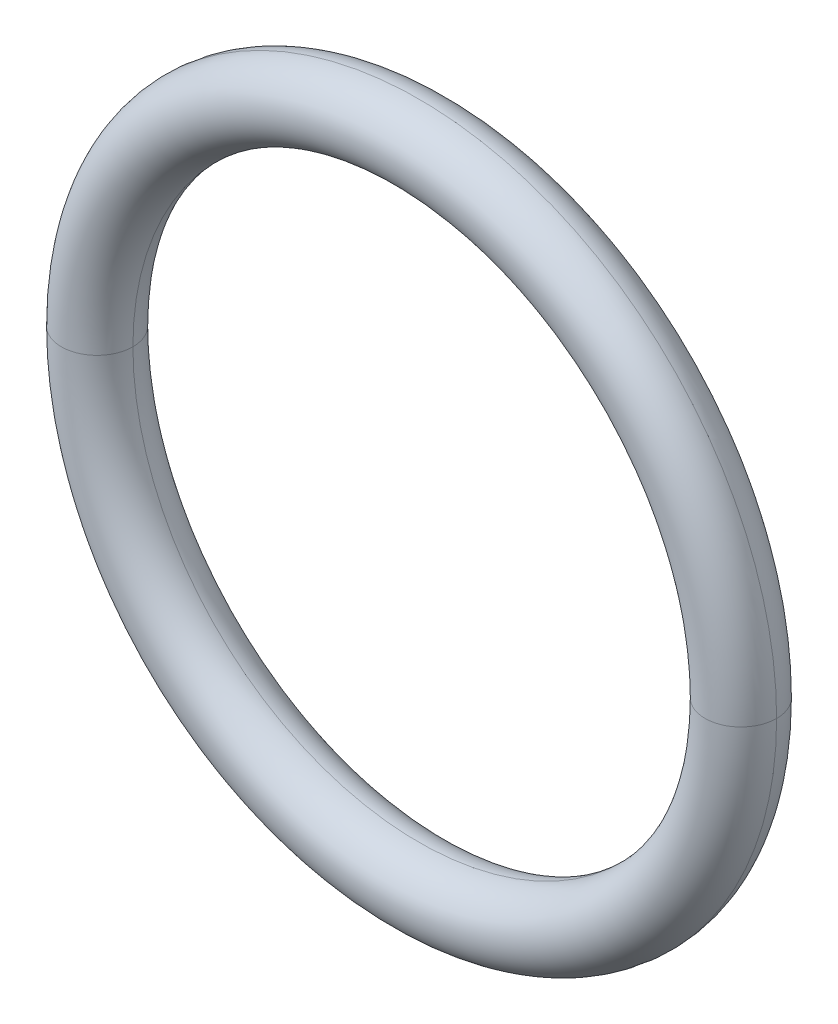
ISO-10303-21;
HEADER;
FILE_DESCRIPTION(('STEP AP214'),'2;1');
FILE_NAME('part.step','',(''),(''),'','','');
FILE_SCHEMA(('AUTOMOTIVE_DESIGN { 1 0 10303 214 1 1 1 1 }'));
ENDSEC;
DATA;
#1=APPLICATION_CONTEXT('core data for automotive mechanical design processes');
#2=APPLICATION_PROTOCOL_DEFINITION('international standard','automotive_design',2000,#1);
#3=PRODUCT_CONTEXT('',#1,'mechanical');
#4=PRODUCT('Part','Part','',(#3));
#5=PRODUCT_RELATED_PRODUCT_CATEGORY('part','',(#4));
#6=PRODUCT_DEFINITION_FORMATION('','',#4);
#7=PRODUCT_DEFINITION_CONTEXT('part definition',#1,'design');
#8=PRODUCT_DEFINITION('design','',#6,#7);
#9=PRODUCT_DEFINITION_SHAPE('','',#8);
#10=(LENGTH_UNIT() NAMED_UNIT(*) SI_UNIT(.MILLI.,.METRE.));
#11=(NAMED_UNIT(*) PLANE_ANGLE_UNIT() SI_UNIT($,.RADIAN.));
#12=(NAMED_UNIT(*) SI_UNIT($,.STERADIAN.) SOLID_ANGLE_UNIT());
#13=UNCERTAINTY_MEASURE_WITH_UNIT(LENGTH_MEASURE(1.E-05),#10,'distance_accuracy_value','');
#14=(GEOMETRIC_REPRESENTATION_CONTEXT(3) GLOBAL_UNCERTAINTY_ASSIGNED_CONTEXT((#13)) GLOBAL_UNIT_ASSIGNED_CONTEXT((#10,
#11,#12)) REPRESENTATION_CONTEXT('',''));
#15=CARTESIAN_POINT('',(0.,0.,0.));
#16=DIRECTION('',(0.,0.,1.));
#17=DIRECTION('',(1.,0.,0.));
#18=AXIS2_PLACEMENT_3D('',#15,#16,#17);
#19=CARTESIAN_POINT('',(0.,0.,0.));
#20=DIRECTION('',(0.,0.,1.));
#21=DIRECTION('',(1.,0.,0.));
#22=AXIS2_PLACEMENT_3D('',#19,#20,#21);
#23=TOROIDAL_SURFACE('',#22,4.5,0.5);
#24=CARTESIAN_POINT('',(-4.5,0.,0.));
#25=DIRECTION('',(0.,1.,0.));
#26=DIRECTION('',(-1.,0.,0.));
#27=AXIS2_PLACEMENT_3D('',#24,#25,#26);
#28=CIRCLE('',#27,0.5);
#29=CARTESIAN_POINT('',(-5.,0.,0.));
#30=VERTEX_POINT('',#29);
#31=CARTESIAN_POINT('',(-4.,0.,0.));
#32=VERTEX_POINT('',#31);
#33=EDGE_CURVE('E40',#30,#32,#28,.T.);
#34=ORIENTED_EDGE('',*,*,#33,.F.);
#35=CARTESIAN_POINT('',(0.,0.,0.));
#36=DIRECTION('',(0.,0.,1.));
#37=DIRECTION('',(1.,0.,0.));
#38=AXIS2_PLACEMENT_3D('',#35,#36,#37);
#39=CIRCLE('',#38,5.);
#40=CARTESIAN_POINT('',(5.,0.,0.));
#41=VERTEX_POINT('',#40);
#42=EDGE_CURVE('E11',#30,#41,#39,.T.);
#43=ORIENTED_EDGE('',*,*,#42,.T.);
#44=CARTESIAN_POINT('',(4.5,0.,0.));
#45=DIRECTION('',(0.,-1.,0.));
#46=DIRECTION('',(1.,0.,0.));
#47=AXIS2_PLACEMENT_3D('',#44,#45,#46);
#48=CIRCLE('',#47,0.5);
#49=CARTESIAN_POINT('',(4.,0.,0.));
#50=VERTEX_POINT('',#49);
#51=EDGE_CURVE('E27',#41,#50,#48,.T.);
#52=ORIENTED_EDGE('',*,*,#51,.T.);
#53=CARTESIAN_POINT('',(0.,0.,0.));
#54=DIRECTION('',(0.,0.,1.));
#55=DIRECTION('',(1.,0.,0.));
#56=AXIS2_PLACEMENT_3D('',#53,#54,#55);
#57=CIRCLE('',#56,4.);
#58=EDGE_CURVE('E52',#32,#50,#57,.T.);
#59=ORIENTED_EDGE('',*,*,#58,.F.);
#60=EDGE_LOOP('',(#34,#43,#52,#59));
#61=FACE_BOUND('',#60,.T.);
#62=ADVANCED_FACE('F16',(#61),#23,.T.);
#63=CARTESIAN_POINT('',(0.,0.,0.));
#64=DIRECTION('',(0.,0.,1.));
#65=DIRECTION('',(1.,0.,0.));
#66=AXIS2_PLACEMENT_3D('',#63,#64,#65);
#67=TOROIDAL_SURFACE('',#66,4.5,0.5);
#68=ORIENTED_EDGE('',*,*,#51,.F.);
#69=CARTESIAN_POINT('',(0.,0.,0.));
#70=DIRECTION('',(0.,0.,1.));
#71=DIRECTION('',(1.,0.,0.));
#72=AXIS2_PLACEMENT_3D('',#69,#70,#71);
#73=CIRCLE('',#72,5.);
#74=EDGE_CURVE('E70',#41,#30,#73,.T.);
#75=ORIENTED_EDGE('',*,*,#74,.T.);
#76=ORIENTED_EDGE('',*,*,#33,.T.);
#77=CARTESIAN_POINT('',(0.,0.,0.));
#78=DIRECTION('',(0.,0.,1.));
#79=DIRECTION('',(1.,0.,0.));
#80=AXIS2_PLACEMENT_3D('',#77,#78,#79);
#81=CIRCLE('',#80,4.);
#82=EDGE_CURVE('E65',#50,#32,#81,.T.);
#83=ORIENTED_EDGE('',*,*,#82,.F.);
#84=EDGE_LOOP('',(#68,#75,#76,#83));
#85=FACE_BOUND('',#84,.T.);
#86=ADVANCED_FACE('F69',(#85),#67,.T.);
#87=CARTESIAN_POINT('',(0.,0.,0.));
#88=DIRECTION('',(0.,0.,1.));
#89=DIRECTION('',(1.,0.,0.));
#90=AXIS2_PLACEMENT_3D('',#87,#88,#89);
#91=TOROIDAL_SURFACE('',#90,4.5,0.5);
#92=ORIENTED_EDGE('',*,*,#74,.F.);
#93=CARTESIAN_POINT('',(4.5,0.,0.));
#94=DIRECTION('',(0.,-1.,0.));
#95=DIRECTION('',(1.,0.,0.));
#96=AXIS2_PLACEMENT_3D('',#93,#94,#95);
#97=CIRCLE('',#96,0.5);
#98=EDGE_CURVE('E20',#50,#41,#97,.T.);
#99=ORIENTED_EDGE('',*,*,#98,.F.);
#100=ORIENTED_EDGE('',*,*,#82,.T.);
#101=CARTESIAN_POINT('',(-4.5,0.,0.));
#102=DIRECTION('',(0.,1.,0.));
#103=DIRECTION('',(-1.,0.,0.));
#104=AXIS2_PLACEMENT_3D('',#101,#102,#103);
#105=CIRCLE('',#104,0.5);
#106=EDGE_CURVE('E61',#32,#30,#105,.T.);
#107=ORIENTED_EDGE('',*,*,#106,.T.);
#108=EDGE_LOOP('',(#92,#99,#100,#107));
#109=FACE_BOUND('',#108,.T.);
#110=ADVANCED_FACE('F18',(#109),#91,.T.);
#111=CARTESIAN_POINT('',(0.,0.,0.));
#112=DIRECTION('',(0.,0.,1.));
#113=DIRECTION('',(1.,0.,0.));
#114=AXIS2_PLACEMENT_3D('',#111,#112,#113);
#115=TOROIDAL_SURFACE('',#114,4.5,0.5);
#116=ORIENTED_EDGE('',*,*,#42,.F.);
#117=ORIENTED_EDGE('',*,*,#106,.F.);
#118=ORIENTED_EDGE('',*,*,#58,.T.);
#119=ORIENTED_EDGE('',*,*,#98,.T.);
#120=EDGE_LOOP('',(#116,#117,#118,#119));
#121=FACE_BOUND('',#120,.T.);
#122=ADVANCED_FACE('F74',(#121),#115,.T.);
#123=CLOSED_SHELL('',(#62,#86,#110,#122));
#124=MANIFOLD_SOLID_BREP('B1',#123);
#125=ADVANCED_BREP_SHAPE_REPRESENTATION('',(#18,#124),#14);
#126=SHAPE_DEFINITION_REPRESENTATION(#9,#125);
ENDSEC;
END-ISO-10303-21;
